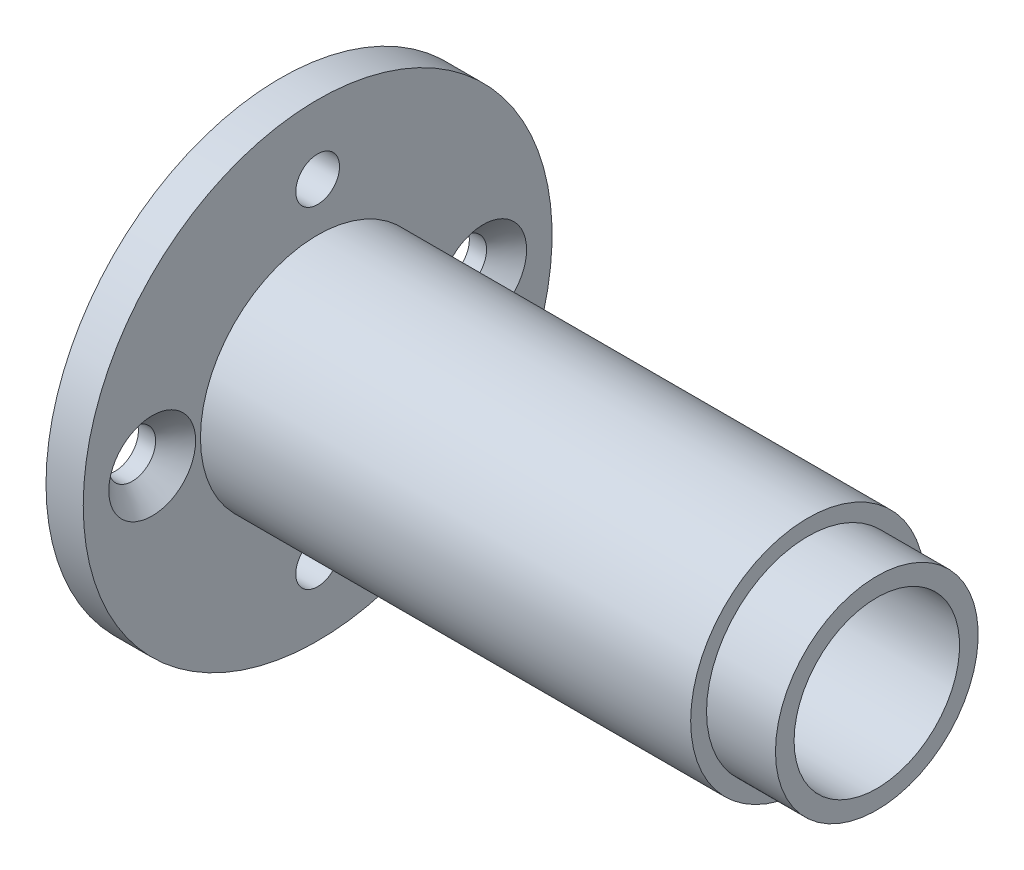
ISO-10303-21;
HEADER;
FILE_DESCRIPTION(('STEP AP214'),'2;1');
FILE_NAME('part.step','',(''),(''),'','','');
FILE_SCHEMA(('AUTOMOTIVE_DESIGN { 1 0 10303 214 1 1 1 1 }'));
ENDSEC;
DATA;
#1=APPLICATION_CONTEXT('core data for automotive mechanical design processes');
#2=APPLICATION_PROTOCOL_DEFINITION('international standard','automotive_design',2000,#1);
#3=PRODUCT_CONTEXT('',#1,'mechanical');
#4=PRODUCT('Part','Part','',(#3));
#5=PRODUCT_RELATED_PRODUCT_CATEGORY('part','',(#4));
#6=PRODUCT_DEFINITION_FORMATION('','',#4);
#7=PRODUCT_DEFINITION_CONTEXT('part definition',#1,'design');
#8=PRODUCT_DEFINITION('design','',#6,#7);
#9=PRODUCT_DEFINITION_SHAPE('','',#8);
#10=(LENGTH_UNIT() NAMED_UNIT(*) SI_UNIT(.MILLI.,.METRE.));
#11=(NAMED_UNIT(*) PLANE_ANGLE_UNIT() SI_UNIT($,.RADIAN.));
#12=(NAMED_UNIT(*) SI_UNIT($,.STERADIAN.) SOLID_ANGLE_UNIT());
#13=UNCERTAINTY_MEASURE_WITH_UNIT(LENGTH_MEASURE(1.E-05),#10,'distance_accuracy_value','');
#14=(GEOMETRIC_REPRESENTATION_CONTEXT(3) GLOBAL_UNCERTAINTY_ASSIGNED_CONTEXT((#13)) GLOBAL_UNIT_ASSIGNED_CONTEXT((#10,
#11,#12)) REPRESENTATION_CONTEXT('',''));
#15=CARTESIAN_POINT('',(0.,0.,0.));
#16=DIRECTION('',(0.,0.,1.));
#17=DIRECTION('',(1.,0.,0.));
#18=AXIS2_PLACEMENT_3D('',#15,#16,#17);
#19=CARTESIAN_POINT('',(227.370475165962,-148.573704322227,0.));
#20=DIRECTION('',(-1.,0.,0.));
#21=DIRECTION('',(0.,0.,1.));
#22=AXIS2_PLACEMENT_3D('',#19,#20,#21);
#23=CYLINDRICAL_SURFACE('',#22,8.50000000000001);
#24=CARTESIAN_POINT('',(299.808388757778,-148.573704322227,0.));
#25=DIRECTION('',(-1.,0.,0.));
#26=DIRECTION('',(0.,0.,1.));
#27=AXIS2_PLACEMENT_3D('',#24,#25,#26);
#28=CIRCLE('',#27,8.50000000000001);
#29=CARTESIAN_POINT('',(299.808388757778,-148.573704322227,8.50000000000001));
#30=VERTEX_POINT('',#29);
#31=EDGE_CURVE('E70',#30,#30,#28,.T.);
#32=ORIENTED_EDGE('',*,*,#31,.T.);
#33=EDGE_LOOP('',(#32));
#34=FACE_BOUND('',#33,.T.);
#35=CARTESIAN_POINT('',(264.258388757778,-148.573704322227,0.));
#36=DIRECTION('',(-1.,0.,0.));
#37=DIRECTION('',(0.,0.,1.));
#38=AXIS2_PLACEMENT_3D('',#35,#36,#37);
#39=CIRCLE('',#38,8.50000000000001);
#40=CARTESIAN_POINT('',(264.258388757778,-148.573704322227,8.50000000000001));
#41=VERTEX_POINT('',#40);
#42=EDGE_CURVE('E10',#41,#41,#39,.T.);
#43=ORIENTED_EDGE('',*,*,#42,.F.);
#44=EDGE_LOOP('',(#43));
#45=FACE_BOUND('',#44,.T.);
#46=ADVANCED_FACE('F34',(#34,#45),#23,.T.);
#47=CARTESIAN_POINT('',(264.258388757778,0.,0.));
#48=DIRECTION('',(-1.,0.,0.));
#49=DIRECTION('',(0.,0.,1.));
#50=AXIS2_PLACEMENT_3D('',#47,#48,#49);
#51=PLANE('',#50);
#52=CARTESIAN_POINT('',(264.258388757778,-148.573704322227,12.));
#53=DIRECTION('',(1.,0.,0.));
#54=DIRECTION('',(0.,0.,-1.));
#55=AXIS2_PLACEMENT_3D('',#52,#53,#54);
#56=CIRCLE('',#55,3.14999999999999);
#57=CARTESIAN_POINT('',(264.258388757778,-148.573704322227,8.85000000000002));
#58=VERTEX_POINT('',#57);
#59=EDGE_CURVE('E270',#58,#58,#56,.T.);
#60=ORIENTED_EDGE('',*,*,#59,.F.);
#61=EDGE_LOOP('',(#60));
#62=FACE_BOUND('',#61,.T.);
#63=CARTESIAN_POINT('',(264.258388757778,-148.573704322227,-12.));
#64=DIRECTION('',(1.,0.,0.));
#65=DIRECTION('',(0.,0.,-1.));
#66=AXIS2_PLACEMENT_3D('',#63,#64,#65);
#67=CIRCLE('',#66,3.14999999999999);
#68=CARTESIAN_POINT('',(264.258388757778,-148.573704322227,-15.15));
#69=VERTEX_POINT('',#68);
#70=EDGE_CURVE('E59',#69,#69,#67,.T.);
#71=ORIENTED_EDGE('',*,*,#70,.F.);
#72=EDGE_LOOP('',(#71));
#73=FACE_BOUND('',#72,.T.);
#74=CARTESIAN_POINT('',(264.258388757778,-136.573704322227,0.));
#75=DIRECTION('',(1.,0.,0.));
#76=DIRECTION('',(0.,0.,-1.));
#77=AXIS2_PLACEMENT_3D('',#74,#75,#76);
#78=CIRCLE('',#77,1.5875);
#79=CARTESIAN_POINT('',(264.258388757778,-136.573704322227,-1.5875));
#80=VERTEX_POINT('',#79);
#81=EDGE_CURVE('E67',#80,#80,#78,.T.);
#82=ORIENTED_EDGE('',*,*,#81,.F.);
#83=EDGE_LOOP('',(#82));
#84=FACE_BOUND('',#83,.T.);
#85=CARTESIAN_POINT('',(264.258388757778,-160.573704322227,0.));
#86=DIRECTION('',(1.,0.,0.));
#87=DIRECTION('',(0.,0.,-1.));
#88=AXIS2_PLACEMENT_3D('',#85,#86,#87);
#89=CIRCLE('',#88,1.5875);
#90=CARTESIAN_POINT('',(264.258388757778,-160.573704322227,-1.5875));
#91=VERTEX_POINT('',#90);
#92=EDGE_CURVE('E56',#91,#91,#89,.T.);
#93=ORIENTED_EDGE('',*,*,#92,.F.);
#94=EDGE_LOOP('',(#93));
#95=FACE_BOUND('',#94,.T.);
#96=CARTESIAN_POINT('',(264.258388757778,-148.573704322227,0.));
#97=DIRECTION('',(-1.,0.,0.));
#98=DIRECTION('',(0.,0.,1.));
#99=AXIS2_PLACEMENT_3D('',#96,#97,#98);
#100=CIRCLE('',#99,17.);
#101=CARTESIAN_POINT('',(264.258388757778,-148.573704322227,17.));
#102=VERTEX_POINT('',#101);
#103=EDGE_CURVE('E41',#102,#102,#100,.T.);
#104=ORIENTED_EDGE('',*,*,#103,.F.);
#105=EDGE_LOOP('',(#104));
#106=FACE_BOUND('',#105,.T.);
#107=ORIENTED_EDGE('',*,*,#42,.T.);
#108=EDGE_LOOP('',(#107));
#109=FACE_BOUND('',#108,.T.);
#110=ADVANCED_FACE('F103',(#62,#73,#84,#95,#106,#109),#51,.F.);
#111=CARTESIAN_POINT('',(227.370475165962,-148.573704322227,0.));
#112=DIRECTION('',(-1.,0.,0.));
#113=DIRECTION('',(0.,0.,1.));
#114=AXIS2_PLACEMENT_3D('',#111,#112,#113);
#115=CYLINDRICAL_SURFACE('',#114,17.);
#116=ORIENTED_EDGE('',*,*,#103,.T.);
#117=EDGE_LOOP('',(#116));
#118=FACE_BOUND('',#117,.T.);
#119=CARTESIAN_POINT('',(261.558388757778,-148.573704322227,0.));
#120=DIRECTION('',(-1.,0.,0.));
#121=DIRECTION('',(0.,0.,1.));
#122=AXIS2_PLACEMENT_3D('',#119,#120,#121);
#123=CIRCLE('',#122,17.);
#124=CARTESIAN_POINT('',(261.558388757778,-148.573704322227,17.));
#125=VERTEX_POINT('',#124);
#126=EDGE_CURVE('E46',#125,#125,#123,.T.);
#127=ORIENTED_EDGE('',*,*,#126,.F.);
#128=EDGE_LOOP('',(#127));
#129=FACE_BOUND('',#128,.T.);
#130=ADVANCED_FACE('F101',(#118,#129),#115,.T.);
#131=CARTESIAN_POINT('',(261.558388757778,0.,0.));
#132=DIRECTION('',(-1.,0.,0.));
#133=DIRECTION('',(0.,0.,1.));
#134=AXIS2_PLACEMENT_3D('',#131,#132,#133);
#135=PLANE('',#134);
#136=CARTESIAN_POINT('',(261.558388757778,-151.472842125092,2.89913780286488));
#137=DIRECTION('',(-1.,0.,0.));
#138=DIRECTION('',(0.,0.,1.));
#139=AXIS2_PLACEMENT_3D('',#136,#137,#138);
#140=CIRCLE('',#139,0.799999999999971);
#141=CARTESIAN_POINT('',(261.558388757778,-151.472842125092,3.69913780286485));
#142=VERTEX_POINT('',#141);
#143=EDGE_CURVE('E265',#142,#142,#140,.T.);
#144=ORIENTED_EDGE('',*,*,#143,.F.);
#145=EDGE_LOOP('',(#144));
#146=FACE_BOUND('',#145,.T.);
#147=CARTESIAN_POINT('',(261.558388757778,-148.573704322227,12.));
#148=DIRECTION('',(-1.,0.,0.));
#149=DIRECTION('',(0.,0.,1.));
#150=AXIS2_PLACEMENT_3D('',#147,#148,#149);
#151=CIRCLE('',#150,1.70000000000001);
#152=CARTESIAN_POINT('',(261.558388757778,-148.573704322227,13.7));
#153=VERTEX_POINT('',#152);
#154=EDGE_CURVE('E37',#153,#153,#151,.T.);
#155=ORIENTED_EDGE('',*,*,#154,.F.);
#156=EDGE_LOOP('',(#155));
#157=FACE_BOUND('',#156,.T.);
#158=CARTESIAN_POINT('',(261.558388757778,-148.573704322227,-12.));
#159=DIRECTION('',(-1.,0.,0.));
#160=DIRECTION('',(0.,0.,1.));
#161=AXIS2_PLACEMENT_3D('',#158,#159,#160);
#162=CIRCLE('',#161,1.70000000000001);
#163=CARTESIAN_POINT('',(261.558388757778,-148.573704322227,-10.3));
#164=VERTEX_POINT('',#163);
#165=EDGE_CURVE('E49',#164,#164,#162,.T.);
#166=ORIENTED_EDGE('',*,*,#165,.F.);
#167=EDGE_LOOP('',(#166));
#168=FACE_BOUND('',#167,.T.);
#169=CARTESIAN_POINT('',(261.558388757778,-136.573704322227,0.));
#170=DIRECTION('',(-1.,0.,0.));
#171=DIRECTION('',(0.,0.,1.));
#172=AXIS2_PLACEMENT_3D('',#169,#170,#171);
#173=CIRCLE('',#172,1.5875);
#174=CARTESIAN_POINT('',(261.558388757778,-136.573704322227,1.5875));
#175=VERTEX_POINT('',#174);
#176=EDGE_CURVE('E71',#175,#175,#173,.F.);
#177=ORIENTED_EDGE('',*,*,#176,.T.);
#178=EDGE_LOOP('',(#177));
#179=FACE_BOUND('',#178,.T.);
#180=CARTESIAN_POINT('',(261.558388757778,-160.573704322227,0.));
#181=DIRECTION('',(-1.,0.,0.));
#182=DIRECTION('',(0.,0.,1.));
#183=AXIS2_PLACEMENT_3D('',#180,#181,#182);
#184=CIRCLE('',#183,1.5875);
#185=CARTESIAN_POINT('',(261.558388757778,-160.573704322227,1.5875));
#186=VERTEX_POINT('',#185);
#187=EDGE_CURVE('E51',#186,#186,#184,.F.);
#188=ORIENTED_EDGE('',*,*,#187,.T.);
#189=EDGE_LOOP('',(#188));
#190=FACE_BOUND('',#189,.T.);
#191=ORIENTED_EDGE('',*,*,#126,.T.);
#192=EDGE_LOOP('',(#191));
#193=FACE_BOUND('',#192,.T.);
#194=CARTESIAN_POINT('',(261.558388757778,-148.573704322227,0.));
#195=DIRECTION('',(-1.,0.,0.));
#196=DIRECTION('',(0.,0.,1.));
#197=AXIS2_PLACEMENT_3D('',#194,#195,#196);
#198=CIRCLE('',#197,3.25);
#199=CARTESIAN_POINT('',(261.558388757778,-148.573704322227,3.25));
#200=VERTEX_POINT('',#199);
#201=EDGE_CURVE('E93',#200,#200,#198,.T.);
#202=ORIENTED_EDGE('',*,*,#201,.F.);
#203=EDGE_LOOP('',(#202));
#204=FACE_BOUND('',#203,.T.);
#205=ADVANCED_FACE('F98',(#146,#157,#168,#179,#190,#193,#204),#135,.T.);
#206=CARTESIAN_POINT('',(227.370475165962,-148.573704322227,0.));
#207=DIRECTION('',(-1.,0.,0.));
#208=DIRECTION('',(0.,0.,1.));
#209=AXIS2_PLACEMENT_3D('',#206,#207,#208);
#210=CYLINDRICAL_SURFACE('',#209,3.25);
#211=CARTESIAN_POINT('',(264.258388757778,-148.573704322227,0.));
#212=DIRECTION('',(-1.,0.,0.));
#213=DIRECTION('',(0.,0.,1.));
#214=AXIS2_PLACEMENT_3D('',#211,#212,#213);
#215=CIRCLE('',#214,3.25);
#216=CARTESIAN_POINT('',(264.258388757778,-148.573704322227,3.25));
#217=VERTEX_POINT('',#216);
#218=EDGE_CURVE('E90',#217,#217,#215,.T.);
#219=ORIENTED_EDGE('',*,*,#218,.F.);
#220=EDGE_LOOP('',(#219));
#221=FACE_BOUND('',#220,.T.);
#222=ORIENTED_EDGE('',*,*,#201,.T.);
#223=EDGE_LOOP('',(#222));
#224=FACE_BOUND('',#223,.T.);
#225=ADVANCED_FACE('F111',(#221,#224),#210,.F.);
#226=CARTESIAN_POINT('',(264.258388757778,0.,0.));
#227=DIRECTION('',(1.,0.,0.));
#228=DIRECTION('',(0.,0.,-1.));
#229=AXIS2_PLACEMENT_3D('',#226,#227,#228);
#230=PLANE('',#229);
#231=CARTESIAN_POINT('',(264.258388757778,-151.472842125092,2.89913780286488));
#232=DIRECTION('',(1.,0.,0.));
#233=DIRECTION('',(0.,0.,-1.));
#234=AXIS2_PLACEMENT_3D('',#231,#232,#233);
#235=CIRCLE('',#234,0.799999999999971);
#236=CARTESIAN_POINT('',(264.258388757778,-151.472842125092,2.09913780286491));
#237=VERTEX_POINT('',#236);
#238=EDGE_CURVE('E268',#237,#237,#235,.T.);
#239=ORIENTED_EDGE('',*,*,#238,.F.);
#240=EDGE_LOOP('',(#239));
#241=FACE_BOUND('',#240,.T.);
#242=ORIENTED_EDGE('',*,*,#218,.T.);
#243=EDGE_LOOP('',(#242));
#244=FACE_BOUND('',#243,.T.);
#245=CARTESIAN_POINT('',(264.258388757778,-148.573704322227,0.));
#246=DIRECTION('',(-1.,0.,0.));
#247=DIRECTION('',(0.,0.,1.));
#248=AXIS2_PLACEMENT_3D('',#245,#246,#247);
#249=CIRCLE('',#248,6.00000000000001);
#250=CARTESIAN_POINT('',(264.258388757778,-148.573704322227,6.00000000000001));
#251=VERTEX_POINT('',#250);
#252=EDGE_CURVE('E87',#251,#251,#249,.T.);
#253=ORIENTED_EDGE('',*,*,#252,.F.);
#254=EDGE_LOOP('',(#253));
#255=FACE_BOUND('',#254,.T.);
#256=ADVANCED_FACE('F146',(#241,#244,#255),#230,.T.);
#257=CARTESIAN_POINT('',(227.370475165962,-148.573704322227,0.));
#258=DIRECTION('',(-1.,0.,0.));
#259=DIRECTION('',(0.,0.,1.));
#260=AXIS2_PLACEMENT_3D('',#257,#258,#259);
#261=CYLINDRICAL_SURFACE('',#260,6.00000000000001);
#262=CARTESIAN_POINT('',(304.808388757778,-148.573704322227,0.));
#263=DIRECTION('',(-1.,0.,0.));
#264=DIRECTION('',(0.,0.,1.));
#265=AXIS2_PLACEMENT_3D('',#262,#263,#264);
#266=CIRCLE('',#265,6.00000000000001);
#267=CARTESIAN_POINT('',(304.808388757778,-148.573704322227,6.00000000000001));
#268=VERTEX_POINT('',#267);
#269=EDGE_CURVE('E84',#268,#268,#266,.T.);
#270=ORIENTED_EDGE('',*,*,#269,.F.);
#271=EDGE_LOOP('',(#270));
#272=FACE_BOUND('',#271,.T.);
#273=ORIENTED_EDGE('',*,*,#252,.T.);
#274=EDGE_LOOP('',(#273));
#275=FACE_BOUND('',#274,.T.);
#276=ADVANCED_FACE('F142',(#272,#275),#261,.F.);
#277=CARTESIAN_POINT('',(304.808388757778,0.,0.));
#278=DIRECTION('',(-1.,0.,0.));
#279=DIRECTION('',(0.,0.,1.));
#280=AXIS2_PLACEMENT_3D('',#277,#278,#279);
#281=PLANE('',#280);
#282=CARTESIAN_POINT('',(304.808388757778,-148.573704322227,0.));
#283=DIRECTION('',(-1.,0.,0.));
#284=DIRECTION('',(0.,0.,1.));
#285=AXIS2_PLACEMENT_3D('',#282,#283,#284);
#286=CIRCLE('',#285,7.35);
#287=CARTESIAN_POINT('',(304.808388757778,-148.573704322227,7.35));
#288=VERTEX_POINT('',#287);
#289=EDGE_CURVE('E81',#288,#288,#286,.T.);
#290=ORIENTED_EDGE('',*,*,#289,.F.);
#291=EDGE_LOOP('',(#290));
#292=FACE_BOUND('',#291,.T.);
#293=ORIENTED_EDGE('',*,*,#269,.T.);
#294=EDGE_LOOP('',(#293));
#295=FACE_BOUND('',#294,.T.);
#296=ADVANCED_FACE('F135',(#292,#295),#281,.F.);
#297=CARTESIAN_POINT('',(227.370475165962,-148.573704322227,0.));
#298=DIRECTION('',(-1.,0.,0.));
#299=DIRECTION('',(0.,0.,1.));
#300=AXIS2_PLACEMENT_3D('',#297,#298,#299);
#301=CYLINDRICAL_SURFACE('',#300,7.35);
#302=ORIENTED_EDGE('',*,*,#289,.T.);
#303=EDGE_LOOP('',(#302));
#304=FACE_BOUND('',#303,.T.);
#305=CARTESIAN_POINT('',(299.808388757778,-148.573704322227,0.));
#306=DIRECTION('',(-1.,0.,0.));
#307=DIRECTION('',(0.,0.,1.));
#308=AXIS2_PLACEMENT_3D('',#305,#306,#307);
#309=CIRCLE('',#308,7.35);
#310=CARTESIAN_POINT('',(299.808388757778,-148.573704322227,7.35));
#311=VERTEX_POINT('',#310);
#312=EDGE_CURVE('E78',#311,#311,#309,.T.);
#313=ORIENTED_EDGE('',*,*,#312,.F.);
#314=EDGE_LOOP('',(#313));
#315=FACE_BOUND('',#314,.T.);
#316=ADVANCED_FACE('F125',(#304,#315),#301,.T.);
#317=CARTESIAN_POINT('',(299.808388757778,0.,0.));
#318=DIRECTION('',(1.,0.,0.));
#319=DIRECTION('',(0.,0.,-1.));
#320=AXIS2_PLACEMENT_3D('',#317,#318,#319);
#321=PLANE('',#320);
#322=ORIENTED_EDGE('',*,*,#312,.T.);
#323=EDGE_LOOP('',(#322));
#324=FACE_BOUND('',#323,.T.);
#325=ORIENTED_EDGE('',*,*,#31,.F.);
#326=EDGE_LOOP('',(#325));
#327=FACE_BOUND('',#326,.T.);
#328=ADVANCED_FACE('F122',(#324,#327),#321,.T.);
#329=CARTESIAN_POINT('',(261.557388757778,-160.573704322227,0.));
#330=DIRECTION('',(1.,0.,0.));
#331=DIRECTION('',(0.,0.,-1.));
#332=AXIS2_PLACEMENT_3D('',#329,#330,#331);
#333=CYLINDRICAL_SURFACE('',#332,1.5875);
#334=ORIENTED_EDGE('',*,*,#187,.F.);
#335=EDGE_LOOP('',(#334));
#336=FACE_BOUND('',#335,.T.);
#337=ORIENTED_EDGE('',*,*,#92,.T.);
#338=EDGE_LOOP('',(#337));
#339=FACE_BOUND('',#338,.T.);
#340=ADVANCED_FACE('F124',(#336,#339),#333,.F.);
#341=CARTESIAN_POINT('',(261.557388757778,-136.573704322227,0.));
#342=DIRECTION('',(1.,0.,0.));
#343=DIRECTION('',(0.,0.,-1.));
#344=AXIS2_PLACEMENT_3D('',#341,#342,#343);
#345=CYLINDRICAL_SURFACE('',#344,1.5875);
#346=ORIENTED_EDGE('',*,*,#176,.F.);
#347=EDGE_LOOP('',(#346));
#348=FACE_BOUND('',#347,.T.);
#349=ORIENTED_EDGE('',*,*,#81,.T.);
#350=EDGE_LOOP('',(#349));
#351=FACE_BOUND('',#350,.T.);
#352=ADVANCED_FACE('F132',(#348,#351),#345,.F.);
#353=CARTESIAN_POINT('',(264.258388757778,-148.573704322227,-12.));
#354=DIRECTION('',(1.,0.,0.));
#355=DIRECTION('',(0.,0.,-1.));
#356=AXIS2_PLACEMENT_3D('',#353,#354,#355);
#357=CYLINDRICAL_SURFACE('',#356,1.70000000000001);
#358=ORIENTED_EDGE('',*,*,#165,.T.);
#359=EDGE_LOOP('',(#358));
#360=FACE_BOUND('',#359,.T.);
#361=CARTESIAN_POINT('',(262.808388757778,-148.573704322227,-12.));
#362=DIRECTION('',(1.,0.,0.));
#363=DIRECTION('',(0.,0.,-1.));
#364=AXIS2_PLACEMENT_3D('',#361,#362,#363);
#365=CIRCLE('',#364,1.70000000000001);
#366=CARTESIAN_POINT('',(262.808388757778,-148.573704322227,-13.7));
#367=VERTEX_POINT('',#366);
#368=EDGE_CURVE('E52',#367,#367,#365,.T.);
#369=ORIENTED_EDGE('',*,*,#368,.T.);
#370=EDGE_LOOP('',(#369));
#371=FACE_BOUND('',#370,.T.);
#372=ADVANCED_FACE('F202',(#360,#371),#357,.F.);
#373=CARTESIAN_POINT('',(264.258388757778,-148.573704322227,-12.));
#374=DIRECTION('',(1.,0.,0.));
#375=DIRECTION('',(0.,0.,-1.));
#376=AXIS2_PLACEMENT_3D('',#373,#374,#375);
#377=CONICAL_SURFACE('',#376,3.14999999999999,0.785398163397439);
#378=ORIENTED_EDGE('',*,*,#368,.F.);
#379=EDGE_LOOP('',(#378));
#380=FACE_BOUND('',#379,.T.);
#381=ORIENTED_EDGE('',*,*,#70,.T.);
#382=EDGE_LOOP('',(#381));
#383=FACE_BOUND('',#382,.T.);
#384=ADVANCED_FACE('F219',(#380,#383),#377,.F.);
#385=CARTESIAN_POINT('',(264.258388757778,-148.573704322227,12.));
#386=DIRECTION('',(1.,0.,0.));
#387=DIRECTION('',(0.,0.,-1.));
#388=AXIS2_PLACEMENT_3D('',#385,#386,#387);
#389=CYLINDRICAL_SURFACE('',#388,1.70000000000001);
#390=ORIENTED_EDGE('',*,*,#154,.T.);
#391=EDGE_LOOP('',(#390));
#392=FACE_BOUND('',#391,.T.);
#393=CARTESIAN_POINT('',(262.808388757778,-148.573704322227,12.));
#394=DIRECTION('',(1.,0.,0.));
#395=DIRECTION('',(0.,0.,-1.));
#396=AXIS2_PLACEMENT_3D('',#393,#394,#395);
#397=CIRCLE('',#396,1.70000000000001);
#398=CARTESIAN_POINT('',(262.808388757778,-148.573704322227,10.3));
#399=VERTEX_POINT('',#398);
#400=EDGE_CURVE('E274',#399,#399,#397,.T.);
#401=ORIENTED_EDGE('',*,*,#400,.T.);
#402=EDGE_LOOP('',(#401));
#403=FACE_BOUND('',#402,.T.);
#404=ADVANCED_FACE('F228',(#392,#403),#389,.F.);
#405=CARTESIAN_POINT('',(264.258388757778,-148.573704322227,12.));
#406=DIRECTION('',(1.,0.,0.));
#407=DIRECTION('',(0.,0.,-1.));
#408=AXIS2_PLACEMENT_3D('',#405,#406,#407);
#409=CONICAL_SURFACE('',#408,3.14999999999999,0.785398163397439);
#410=ORIENTED_EDGE('',*,*,#400,.F.);
#411=EDGE_LOOP('',(#410));
#412=FACE_BOUND('',#411,.T.);
#413=ORIENTED_EDGE('',*,*,#59,.T.);
#414=EDGE_LOOP('',(#413));
#415=FACE_BOUND('',#414,.T.);
#416=ADVANCED_FACE('F238',(#412,#415),#409,.F.);
#417=CARTESIAN_POINT('',(254.258388757778,-151.472842125092,2.89913780286488));
#418=DIRECTION('',(1.,0.,0.));
#419=DIRECTION('',(0.,0.,-1.));
#420=AXIS2_PLACEMENT_3D('',#417,#418,#419);
#421=CYLINDRICAL_SURFACE('',#420,0.799999999999971);
#422=ORIENTED_EDGE('',*,*,#143,.T.);
#423=EDGE_LOOP('',(#422));
#424=FACE_BOUND('',#423,.T.);
#425=ORIENTED_EDGE('',*,*,#238,.T.);
#426=EDGE_LOOP('',(#425));
#427=FACE_BOUND('',#426,.T.);
#428=ADVANCED_FACE('F247',(#424,#427),#421,.F.);
#429=CLOSED_SHELL('',(#46,#110,#130,#205,#225,#256,#276,#296,#316,#328,#340,#352,#372,#384,#404,
#416,#428));
#430=MANIFOLD_SOLID_BREP('B2',#429);
#431=ADVANCED_BREP_SHAPE_REPRESENTATION('',(#18,#430),#14);
#432=SHAPE_DEFINITION_REPRESENTATION(#9,#431);
ENDSEC;
END-ISO-10303-21;
